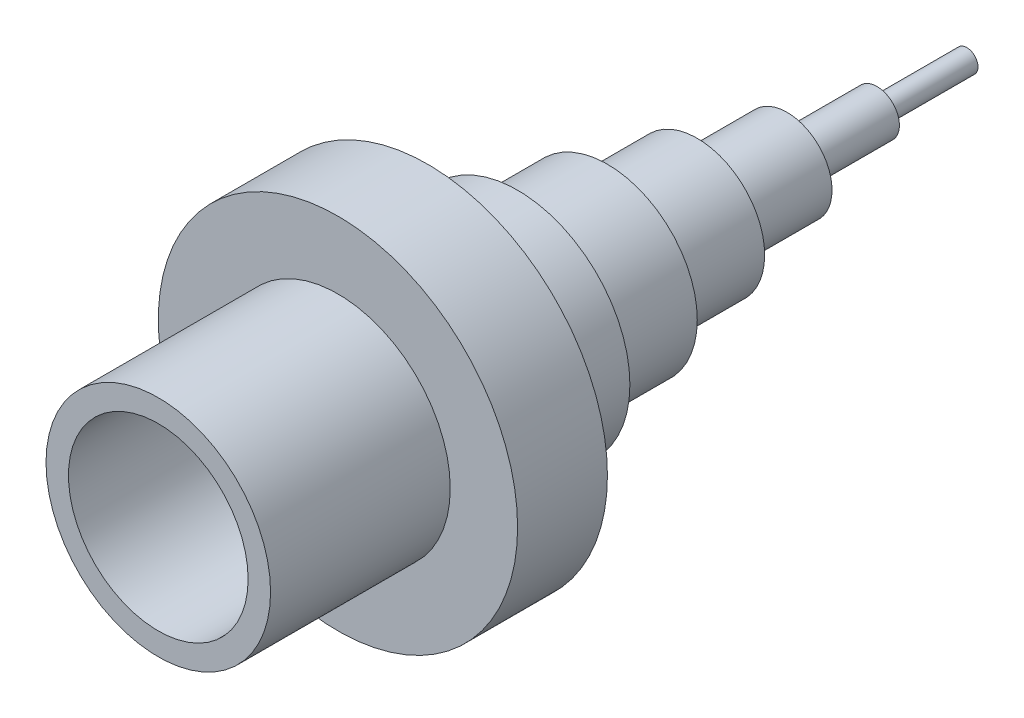
ISO-10303-21;
HEADER;
FILE_DESCRIPTION(('STEP AP214'),'2;1');
FILE_NAME('part.step','',(''),(''),'','','');
FILE_SCHEMA(('AUTOMOTIVE_DESIGN { 1 0 10303 214 1 1 1 1 }'));
ENDSEC;
DATA;
#1=APPLICATION_CONTEXT('core data for automotive mechanical design processes');
#2=APPLICATION_PROTOCOL_DEFINITION('international standard','automotive_design',2000,#1);
#3=PRODUCT_CONTEXT('',#1,'mechanical');
#4=PRODUCT('Part','Part','',(#3));
#5=PRODUCT_RELATED_PRODUCT_CATEGORY('part','',(#4));
#6=PRODUCT_DEFINITION_FORMATION('','',#4);
#7=PRODUCT_DEFINITION_CONTEXT('part definition',#1,'design');
#8=PRODUCT_DEFINITION('design','',#6,#7);
#9=PRODUCT_DEFINITION_SHAPE('','',#8);
#10=(LENGTH_UNIT() NAMED_UNIT(*) SI_UNIT(.MILLI.,.METRE.));
#11=(NAMED_UNIT(*) PLANE_ANGLE_UNIT() SI_UNIT($,.RADIAN.));
#12=(NAMED_UNIT(*) SI_UNIT($,.STERADIAN.) SOLID_ANGLE_UNIT());
#13=UNCERTAINTY_MEASURE_WITH_UNIT(LENGTH_MEASURE(1.E-05),#10,'distance_accuracy_value','');
#14=(GEOMETRIC_REPRESENTATION_CONTEXT(3) GLOBAL_UNCERTAINTY_ASSIGNED_CONTEXT((#13)) GLOBAL_UNIT_ASSIGNED_CONTEXT((#10,
#11,#12)) REPRESENTATION_CONTEXT('',''));
#15=CARTESIAN_POINT('',(0.,0.,0.));
#16=DIRECTION('',(0.,0.,1.));
#17=DIRECTION('',(1.,0.,0.));
#18=AXIS2_PLACEMENT_3D('',#15,#16,#17);
#19=CARTESIAN_POINT('',(0.,25.,-40.));
#20=DIRECTION('',(0.,0.,-1.));
#21=DIRECTION('',(-1.,0.,0.));
#22=AXIS2_PLACEMENT_3D('',#19,#20,#21);
#23=PLANE('',#22);
#24=CARTESIAN_POINT('',(0.,0.,-40.));
#25=DIRECTION('',(0.,0.,1.));
#26=DIRECTION('',(1.,0.,0.));
#27=AXIS2_PLACEMENT_3D('',#24,#25,#26);
#28=CIRCLE('',#27,25.);
#29=CARTESIAN_POINT('',(25.,0.,-40.));
#30=VERTEX_POINT('',#29);
#31=EDGE_CURVE('E89',#30,#30,#28,.T.);
#32=ORIENTED_EDGE('',*,*,#31,.F.);
#33=EDGE_LOOP('',(#32));
#34=FACE_BOUND('',#33,.T.);
#35=CARTESIAN_POINT('',(0.,0.,-40.));
#36=DIRECTION('',(0.,0.,1.));
#37=DIRECTION('',(1.,0.,0.));
#38=AXIS2_PLACEMENT_3D('',#35,#36,#37);
#39=CIRCLE('',#38,40.);
#40=CARTESIAN_POINT('',(40.,0.,-40.));
#41=VERTEX_POINT('',#40);
#42=EDGE_CURVE('E10',#41,#41,#39,.T.);
#43=ORIENTED_EDGE('',*,*,#42,.T.);
#44=EDGE_LOOP('',(#43));
#45=FACE_BOUND('',#44,.T.);
#46=ADVANCED_FACE('F31',(#34,#45),#23,.F.);
#47=CARTESIAN_POINT('',(0.,0.,0.));
#48=DIRECTION('',(0.,0.,1.));
#49=DIRECTION('',(1.,0.,0.));
#50=AXIS2_PLACEMENT_3D('',#47,#48,#49);
#51=CYLINDRICAL_SURFACE('',#50,40.);
#52=ORIENTED_EDGE('',*,*,#42,.F.);
#53=EDGE_LOOP('',(#52));
#54=FACE_BOUND('',#53,.T.);
#55=CARTESIAN_POINT('',(0.,0.,-60.0000000000001));
#56=DIRECTION('',(0.,0.,1.));
#57=DIRECTION('',(1.,0.,0.));
#58=AXIS2_PLACEMENT_3D('',#55,#56,#57);
#59=CIRCLE('',#58,40.);
#60=CARTESIAN_POINT('',(40.,0.,-60.0000000000001));
#61=VERTEX_POINT('',#60);
#62=EDGE_CURVE('E37',#61,#61,#59,.T.);
#63=ORIENTED_EDGE('',*,*,#62,.T.);
#64=EDGE_LOOP('',(#63));
#65=FACE_BOUND('',#64,.T.);
#66=ADVANCED_FACE('F96',(#54,#65),#51,.T.);
#67=CARTESIAN_POINT('',(0.,40.,-60.0000000000001));
#68=DIRECTION('',(0.,0.,1.));
#69=DIRECTION('',(1.,0.,0.));
#70=AXIS2_PLACEMENT_3D('',#67,#68,#69);
#71=PLANE('',#70);
#72=ORIENTED_EDGE('',*,*,#62,.F.);
#73=EDGE_LOOP('',(#72));
#74=FACE_BOUND('',#73,.T.);
#75=CARTESIAN_POINT('',(0.,0.,-60.0000000000001));
#76=DIRECTION('',(0.,0.,1.));
#77=DIRECTION('',(1.,0.,0.));
#78=AXIS2_PLACEMENT_3D('',#75,#76,#77);
#79=CIRCLE('',#78,25.);
#80=CARTESIAN_POINT('',(25.,0.,-60.0000000000001));
#81=VERTEX_POINT('',#80);
#82=EDGE_CURVE('E41',#81,#81,#79,.T.);
#83=ORIENTED_EDGE('',*,*,#82,.T.);
#84=EDGE_LOOP('',(#83));
#85=FACE_BOUND('',#84,.T.);
#86=ADVANCED_FACE('F100',(#74,#85),#71,.F.);
#87=CARTESIAN_POINT('',(0.,0.,0.));
#88=DIRECTION('',(0.,0.,1.));
#89=DIRECTION('',(1.,0.,0.));
#90=AXIS2_PLACEMENT_3D('',#87,#88,#89);
#91=CYLINDRICAL_SURFACE('',#90,25.);
#92=ORIENTED_EDGE('',*,*,#82,.F.);
#93=EDGE_LOOP('',(#92));
#94=FACE_BOUND('',#93,.T.);
#95=CARTESIAN_POINT('',(0.,0.,-80.));
#96=DIRECTION('',(0.,0.,1.));
#97=DIRECTION('',(1.,0.,0.));
#98=AXIS2_PLACEMENT_3D('',#95,#96,#97);
#99=CIRCLE('',#98,25.);
#100=CARTESIAN_POINT('',(25.,0.,-80.));
#101=VERTEX_POINT('',#100);
#102=EDGE_CURVE('E45',#101,#101,#99,.T.);
#103=ORIENTED_EDGE('',*,*,#102,.T.);
#104=EDGE_LOOP('',(#103));
#105=FACE_BOUND('',#104,.T.);
#106=ADVANCED_FACE('F105',(#94,#105),#91,.T.);
#107=CARTESIAN_POINT('',(0.,25.,-80.));
#108=DIRECTION('',(0.,0.,1.));
#109=DIRECTION('',(1.,0.,0.));
#110=AXIS2_PLACEMENT_3D('',#107,#108,#109);
#111=PLANE('',#110);
#112=ORIENTED_EDGE('',*,*,#102,.F.);
#113=EDGE_LOOP('',(#112));
#114=FACE_BOUND('',#113,.T.);
#115=CARTESIAN_POINT('',(0.,0.,-80.));
#116=DIRECTION('',(0.,0.,1.));
#117=DIRECTION('',(1.,0.,0.));
#118=AXIS2_PLACEMENT_3D('',#115,#116,#117);
#119=CIRCLE('',#118,20.);
#120=CARTESIAN_POINT('',(20.,0.,-80.));
#121=VERTEX_POINT('',#120);
#122=EDGE_CURVE('E50',#121,#121,#119,.T.);
#123=ORIENTED_EDGE('',*,*,#122,.T.);
#124=EDGE_LOOP('',(#123));
#125=FACE_BOUND('',#124,.T.);
#126=ADVANCED_FACE('F111',(#114,#125),#111,.F.);
#127=CARTESIAN_POINT('',(0.,0.,0.));
#128=DIRECTION('',(0.,0.,1.));
#129=DIRECTION('',(1.,0.,0.));
#130=AXIS2_PLACEMENT_3D('',#127,#128,#129);
#131=CYLINDRICAL_SURFACE('',#130,20.);
#132=ORIENTED_EDGE('',*,*,#122,.F.);
#133=EDGE_LOOP('',(#132));
#134=FACE_BOUND('',#133,.T.);
#135=CARTESIAN_POINT('',(0.,0.,-100.));
#136=DIRECTION('',(0.,0.,1.));
#137=DIRECTION('',(1.,0.,0.));
#138=AXIS2_PLACEMENT_3D('',#135,#136,#137);
#139=CIRCLE('',#138,20.);
#140=CARTESIAN_POINT('',(20.,0.,-100.));
#141=VERTEX_POINT('',#140);
#142=EDGE_CURVE('E53',#141,#141,#139,.T.);
#143=ORIENTED_EDGE('',*,*,#142,.T.);
#144=EDGE_LOOP('',(#143));
#145=FACE_BOUND('',#144,.T.);
#146=ADVANCED_FACE('F115',(#134,#145),#131,.T.);
#147=CARTESIAN_POINT('',(0.,20.,-100.));
#148=DIRECTION('',(0.,0.,1.));
#149=DIRECTION('',(1.,0.,0.));
#150=AXIS2_PLACEMENT_3D('',#147,#148,#149);
#151=PLANE('',#150);
#152=ORIENTED_EDGE('',*,*,#142,.F.);
#153=EDGE_LOOP('',(#152));
#154=FACE_BOUND('',#153,.T.);
#155=CARTESIAN_POINT('',(0.,0.,-100.));
#156=DIRECTION('',(0.,0.,1.));
#157=DIRECTION('',(1.,0.,0.));
#158=AXIS2_PLACEMENT_3D('',#155,#156,#157);
#159=CIRCLE('',#158,15.);
#160=CARTESIAN_POINT('',(15.,0.,-100.));
#161=VERTEX_POINT('',#160);
#162=EDGE_CURVE('E56',#161,#161,#159,.T.);
#163=ORIENTED_EDGE('',*,*,#162,.T.);
#164=EDGE_LOOP('',(#163));
#165=FACE_BOUND('',#164,.T.);
#166=ADVANCED_FACE('F119',(#154,#165),#151,.F.);
#167=CARTESIAN_POINT('',(0.,0.,0.));
#168=DIRECTION('',(0.,0.,1.));
#169=DIRECTION('',(1.,0.,0.));
#170=AXIS2_PLACEMENT_3D('',#167,#168,#169);
#171=CYLINDRICAL_SURFACE('',#170,15.);
#172=ORIENTED_EDGE('',*,*,#162,.F.);
#173=EDGE_LOOP('',(#172));
#174=FACE_BOUND('',#173,.T.);
#175=CARTESIAN_POINT('',(0.,0.,-120.));
#176=DIRECTION('',(0.,0.,1.));
#177=DIRECTION('',(1.,0.,0.));
#178=AXIS2_PLACEMENT_3D('',#175,#176,#177);
#179=CIRCLE('',#178,15.);
#180=CARTESIAN_POINT('',(15.,0.,-120.));
#181=VERTEX_POINT('',#180);
#182=EDGE_CURVE('E59',#181,#181,#179,.T.);
#183=ORIENTED_EDGE('',*,*,#182,.T.);
#184=EDGE_LOOP('',(#183));
#185=FACE_BOUND('',#184,.T.);
#186=ADVANCED_FACE('F123',(#174,#185),#171,.T.);
#187=CARTESIAN_POINT('',(0.,15.,-120.));
#188=DIRECTION('',(0.,0.,1.));
#189=DIRECTION('',(1.,0.,0.));
#190=AXIS2_PLACEMENT_3D('',#187,#188,#189);
#191=PLANE('',#190);
#192=ORIENTED_EDGE('',*,*,#182,.F.);
#193=EDGE_LOOP('',(#192));
#194=FACE_BOUND('',#193,.T.);
#195=CARTESIAN_POINT('',(0.,0.,-120.));
#196=DIRECTION('',(0.,0.,1.));
#197=DIRECTION('',(1.,0.,0.));
#198=AXIS2_PLACEMENT_3D('',#195,#196,#197);
#199=CIRCLE('',#198,10.);
#200=CARTESIAN_POINT('',(10.,0.,-120.));
#201=VERTEX_POINT('',#200);
#202=EDGE_CURVE('E62',#201,#201,#199,.T.);
#203=ORIENTED_EDGE('',*,*,#202,.T.);
#204=EDGE_LOOP('',(#203));
#205=FACE_BOUND('',#204,.T.);
#206=ADVANCED_FACE('F127',(#194,#205),#191,.F.);
#207=CARTESIAN_POINT('',(0.,0.,0.));
#208=DIRECTION('',(0.,0.,1.));
#209=DIRECTION('',(1.,0.,0.));
#210=AXIS2_PLACEMENT_3D('',#207,#208,#209);
#211=CYLINDRICAL_SURFACE('',#210,10.);
#212=ORIENTED_EDGE('',*,*,#202,.F.);
#213=EDGE_LOOP('',(#212));
#214=FACE_BOUND('',#213,.T.);
#215=CARTESIAN_POINT('',(0.,0.,-140.));
#216=DIRECTION('',(0.,0.,1.));
#217=DIRECTION('',(1.,0.,0.));
#218=AXIS2_PLACEMENT_3D('',#215,#216,#217);
#219=CIRCLE('',#218,10.);
#220=CARTESIAN_POINT('',(10.,0.,-140.));
#221=VERTEX_POINT('',#220);
#222=EDGE_CURVE('E65',#221,#221,#219,.T.);
#223=ORIENTED_EDGE('',*,*,#222,.T.);
#224=EDGE_LOOP('',(#223));
#225=FACE_BOUND('',#224,.T.);
#226=ADVANCED_FACE('F131',(#214,#225),#211,.T.);
#227=CARTESIAN_POINT('',(0.,10.,-140.));
#228=DIRECTION('',(0.,0.,1.));
#229=DIRECTION('',(1.,0.,0.));
#230=AXIS2_PLACEMENT_3D('',#227,#228,#229);
#231=PLANE('',#230);
#232=ORIENTED_EDGE('',*,*,#222,.F.);
#233=EDGE_LOOP('',(#232));
#234=FACE_BOUND('',#233,.T.);
#235=CARTESIAN_POINT('',(0.,0.,-140.));
#236=DIRECTION('',(0.,0.,1.));
#237=DIRECTION('',(1.,0.,0.));
#238=AXIS2_PLACEMENT_3D('',#235,#236,#237);
#239=CIRCLE('',#238,5.);
#240=CARTESIAN_POINT('',(5.,0.,-140.));
#241=VERTEX_POINT('',#240);
#242=EDGE_CURVE('E68',#241,#241,#239,.T.);
#243=ORIENTED_EDGE('',*,*,#242,.T.);
#244=EDGE_LOOP('',(#243));
#245=FACE_BOUND('',#244,.T.);
#246=ADVANCED_FACE('F135',(#234,#245),#231,.F.);
#247=CARTESIAN_POINT('',(0.,0.,0.));
#248=DIRECTION('',(0.,0.,1.));
#249=DIRECTION('',(1.,0.,0.));
#250=AXIS2_PLACEMENT_3D('',#247,#248,#249);
#251=CYLINDRICAL_SURFACE('',#250,5.);
#252=ORIENTED_EDGE('',*,*,#242,.F.);
#253=EDGE_LOOP('',(#252));
#254=FACE_BOUND('',#253,.T.);
#255=CARTESIAN_POINT('',(0.,0.,-160.));
#256=DIRECTION('',(0.,0.,1.));
#257=DIRECTION('',(1.,0.,0.));
#258=AXIS2_PLACEMENT_3D('',#255,#256,#257);
#259=CIRCLE('',#258,5.);
#260=CARTESIAN_POINT('',(5.,0.,-160.));
#261=VERTEX_POINT('',#260);
#262=EDGE_CURVE('E71',#261,#261,#259,.T.);
#263=ORIENTED_EDGE('',*,*,#262,.T.);
#264=EDGE_LOOP('',(#263));
#265=FACE_BOUND('',#264,.T.);
#266=ADVANCED_FACE('F139',(#254,#265),#251,.T.);
#267=CARTESIAN_POINT('',(0.,5.,-160.));
#268=DIRECTION('',(0.,0.,1.));
#269=DIRECTION('',(1.,0.,0.));
#270=AXIS2_PLACEMENT_3D('',#267,#268,#269);
#271=PLANE('',#270);
#272=ORIENTED_EDGE('',*,*,#262,.F.);
#273=EDGE_LOOP('',(#272));
#274=FACE_BOUND('',#273,.T.);
#275=CARTESIAN_POINT('',(0.,0.,-160.));
#276=DIRECTION('',(0.,0.,1.));
#277=DIRECTION('',(1.,0.,0.));
#278=AXIS2_PLACEMENT_3D('',#275,#276,#277);
#279=CIRCLE('',#278,2.5);
#280=CARTESIAN_POINT('',(2.5,0.,-160.));
#281=VERTEX_POINT('',#280);
#282=EDGE_CURVE('E74',#281,#281,#279,.T.);
#283=ORIENTED_EDGE('',*,*,#282,.T.);
#284=EDGE_LOOP('',(#283));
#285=FACE_BOUND('',#284,.T.);
#286=ADVANCED_FACE('F143',(#274,#285),#271,.F.);
#287=CARTESIAN_POINT('',(0.,0.,0.));
#288=DIRECTION('',(0.,0.,1.));
#289=DIRECTION('',(1.,0.,0.));
#290=AXIS2_PLACEMENT_3D('',#287,#288,#289);
#291=CYLINDRICAL_SURFACE('',#290,2.5);
#292=ORIENTED_EDGE('',*,*,#282,.F.);
#293=EDGE_LOOP('',(#292));
#294=FACE_BOUND('',#293,.T.);
#295=CARTESIAN_POINT('',(0.,0.,-180.));
#296=DIRECTION('',(0.,0.,1.));
#297=DIRECTION('',(1.,0.,0.));
#298=AXIS2_PLACEMENT_3D('',#295,#296,#297);
#299=CIRCLE('',#298,2.5);
#300=CARTESIAN_POINT('',(2.5,0.,-180.));
#301=VERTEX_POINT('',#300);
#302=EDGE_CURVE('E77',#301,#301,#299,.T.);
#303=ORIENTED_EDGE('',*,*,#302,.T.);
#304=EDGE_LOOP('',(#303));
#305=FACE_BOUND('',#304,.T.);
#306=ADVANCED_FACE('F147',(#294,#305),#291,.T.);
#307=CARTESIAN_POINT('',(0.,2.5,-180.));
#308=DIRECTION('',(0.,0.,1.));
#309=DIRECTION('',(1.,0.,0.));
#310=AXIS2_PLACEMENT_3D('',#307,#308,#309);
#311=PLANE('',#310);
#312=ORIENTED_EDGE('',*,*,#302,.F.);
#313=EDGE_LOOP('',(#312));
#314=FACE_BOUND('',#313,.T.);
#315=ADVANCED_FACE('F151',(#314),#311,.F.);
#316=CARTESIAN_POINT('',(0.,20.,-40.));
#317=DIRECTION('',(0.,0.,-1.));
#318=DIRECTION('',(-1.,0.,0.));
#319=AXIS2_PLACEMENT_3D('',#316,#317,#318);
#320=PLANE('',#319);
#321=CARTESIAN_POINT('',(0.,0.,-40.));
#322=DIRECTION('',(0.,0.,1.));
#323=DIRECTION('',(1.,0.,0.));
#324=AXIS2_PLACEMENT_3D('',#321,#322,#323);
#325=CIRCLE('',#324,20.);
#326=CARTESIAN_POINT('',(20.,0.,-40.));
#327=VERTEX_POINT('',#326);
#328=EDGE_CURVE('E80',#327,#327,#325,.T.);
#329=ORIENTED_EDGE('',*,*,#328,.T.);
#330=EDGE_LOOP('',(#329));
#331=FACE_BOUND('',#330,.T.);
#332=ADVANCED_FACE('F155',(#331),#320,.F.);
#333=CARTESIAN_POINT('',(0.,0.,0.));
#334=DIRECTION('',(0.,0.,1.));
#335=DIRECTION('',(1.,0.,0.));
#336=AXIS2_PLACEMENT_3D('',#333,#334,#335);
#337=CYLINDRICAL_SURFACE('',#336,20.);
#338=ORIENTED_EDGE('',*,*,#328,.F.);
#339=EDGE_LOOP('',(#338));
#340=FACE_BOUND('',#339,.T.);
#341=CARTESIAN_POINT('',(0.,0.,0.));
#342=DIRECTION('',(0.,0.,1.));
#343=DIRECTION('',(1.,0.,0.));
#344=AXIS2_PLACEMENT_3D('',#341,#342,#343);
#345=CIRCLE('',#344,20.);
#346=CARTESIAN_POINT('',(20.,0.,0.));
#347=VERTEX_POINT('',#346);
#348=EDGE_CURVE('E83',#347,#347,#345,.T.);
#349=ORIENTED_EDGE('',*,*,#348,.T.);
#350=EDGE_LOOP('',(#349));
#351=FACE_BOUND('',#350,.T.);
#352=ADVANCED_FACE('F159',(#340,#351),#337,.F.);
#353=CARTESIAN_POINT('',(0.,25.,0.));
#354=DIRECTION('',(0.,0.,-1.));
#355=DIRECTION('',(-1.,0.,0.));
#356=AXIS2_PLACEMENT_3D('',#353,#354,#355);
#357=PLANE('',#356);
#358=ORIENTED_EDGE('',*,*,#348,.F.);
#359=EDGE_LOOP('',(#358));
#360=FACE_BOUND('',#359,.T.);
#361=CARTESIAN_POINT('',(0.,0.,0.));
#362=DIRECTION('',(0.,0.,1.));
#363=DIRECTION('',(1.,0.,0.));
#364=AXIS2_PLACEMENT_3D('',#361,#362,#363);
#365=CIRCLE('',#364,25.);
#366=CARTESIAN_POINT('',(25.,0.,0.));
#367=VERTEX_POINT('',#366);
#368=EDGE_CURVE('E86',#367,#367,#365,.T.);
#369=ORIENTED_EDGE('',*,*,#368,.T.);
#370=EDGE_LOOP('',(#369));
#371=FACE_BOUND('',#370,.T.);
#372=ADVANCED_FACE('F163',(#360,#371),#357,.F.);
#373=CARTESIAN_POINT('',(0.,0.,0.));
#374=DIRECTION('',(0.,0.,1.));
#375=DIRECTION('',(1.,0.,0.));
#376=AXIS2_PLACEMENT_3D('',#373,#374,#375);
#377=CYLINDRICAL_SURFACE('',#376,25.);
#378=ORIENTED_EDGE('',*,*,#368,.F.);
#379=EDGE_LOOP('',(#378));
#380=FACE_BOUND('',#379,.T.);
#381=ORIENTED_EDGE('',*,*,#31,.T.);
#382=EDGE_LOOP('',(#381));
#383=FACE_BOUND('',#382,.T.);
#384=ADVANCED_FACE('F93',(#380,#383),#377,.T.);
#385=CLOSED_SHELL('',(#46,#66,#86,#106,#126,#146,#166,#186,#206,#226,#246,#266,#286,#306,#315,
#332,#352,#372,#384));
#386=MANIFOLD_SOLID_BREP('B2',#385);
#387=ADVANCED_BREP_SHAPE_REPRESENTATION('',(#18,#386),#14);
#388=SHAPE_DEFINITION_REPRESENTATION(#9,#387);
ENDSEC;
END-ISO-10303-21;
